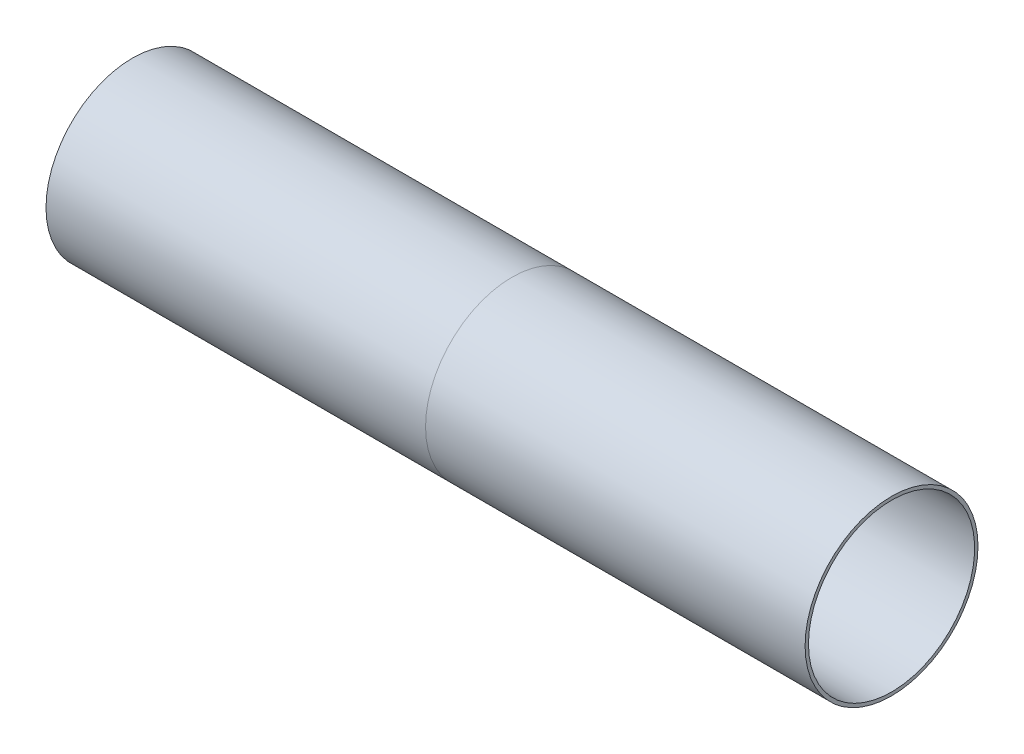
ISO-10303-21;
HEADER;
FILE_DESCRIPTION(('STEP AP214'),'2;1');
FILE_NAME('part.step','',(''),(''),'','','');
FILE_SCHEMA(('AUTOMOTIVE_DESIGN { 1 0 10303 214 1 1 1 1 }'));
ENDSEC;
DATA;
#1=APPLICATION_CONTEXT('core data for automotive mechanical design processes');
#2=APPLICATION_PROTOCOL_DEFINITION('international standard','automotive_design',2000,#1);
#3=PRODUCT_CONTEXT('',#1,'mechanical');
#4=PRODUCT('Part','Part','',(#3));
#5=PRODUCT_RELATED_PRODUCT_CATEGORY('part','',(#4));
#6=PRODUCT_DEFINITION_FORMATION('','',#4);
#7=PRODUCT_DEFINITION_CONTEXT('part definition',#1,'design');
#8=PRODUCT_DEFINITION('design','',#6,#7);
#9=PRODUCT_DEFINITION_SHAPE('','',#8);
#10=(LENGTH_UNIT() NAMED_UNIT(*) SI_UNIT(.MILLI.,.METRE.));
#11=(NAMED_UNIT(*) PLANE_ANGLE_UNIT() SI_UNIT($,.RADIAN.));
#12=(NAMED_UNIT(*) SI_UNIT($,.STERADIAN.) SOLID_ANGLE_UNIT());
#13=UNCERTAINTY_MEASURE_WITH_UNIT(LENGTH_MEASURE(1.E-05),#10,'distance_accuracy_value','');
#14=(GEOMETRIC_REPRESENTATION_CONTEXT(3) GLOBAL_UNCERTAINTY_ASSIGNED_CONTEXT((#13)) GLOBAL_UNIT_ASSIGNED_CONTEXT((#10,
#11,#12)) REPRESENTATION_CONTEXT('',''));
#15=CARTESIAN_POINT('',(0.,0.,0.));
#16=DIRECTION('',(0.,0.,1.));
#17=DIRECTION('',(1.,0.,0.));
#18=AXIS2_PLACEMENT_3D('',#15,#16,#17);
#19=CARTESIAN_POINT('',(-28.6217050315962,0.,-36.7));
#20=DIRECTION('',(1.,0.,0.));
#21=DIRECTION('',(0.,0.,-1.));
#22=AXIS2_PLACEMENT_3D('',#19,#20,#21);
#23=PLANE('',#22);
#24=CARTESIAN_POINT('',(-28.6217050315962,0.,0.));
#25=DIRECTION('',(-1.,0.,0.));
#26=DIRECTION('',(0.,0.,1.));
#27=AXIS2_PLACEMENT_3D('',#24,#25,#26);
#28=CIRCLE('',#27,36.7);
#29=CARTESIAN_POINT('',(-28.6217050315962,0.,36.7));
#30=VERTEX_POINT('',#29);
#31=EDGE_CURVE('E11',#30,#30,#28,.T.);
#32=ORIENTED_EDGE('',*,*,#31,.F.);
#33=EDGE_LOOP('',(#32));
#34=FACE_BOUND('',#33,.T.);
#35=CARTESIAN_POINT('',(-28.6217050315962,0.,0.));
#36=DIRECTION('',(-1.,0.,0.));
#37=DIRECTION('',(0.,0.,1.));
#38=AXIS2_PLACEMENT_3D('',#35,#36,#37);
#39=CIRCLE('',#38,37.9);
#40=CARTESIAN_POINT('',(-28.6217050315962,0.,37.9));
#41=VERTEX_POINT('',#40);
#42=EDGE_CURVE('E86',#41,#41,#39,.T.);
#43=ORIENTED_EDGE('',*,*,#42,.T.);
#44=EDGE_LOOP('',(#43));
#45=FACE_BOUND('',#44,.T.);
#46=ADVANCED_FACE('F62',(#34,#45),#23,.F.);
#47=CARTESIAN_POINT('',(0.,0.,0.));
#48=DIRECTION('',(-1.,0.,0.));
#49=DIRECTION('',(0.,0.,1.));
#50=AXIS2_PLACEMENT_3D('',#47,#48,#49);
#51=CYLINDRICAL_SURFACE('',#50,36.7);
#52=CARTESIAN_POINT('',(28.6217050315962,0.,0.));
#53=DIRECTION('',(-1.,0.,0.));
#54=DIRECTION('',(0.,0.,1.));
#55=AXIS2_PLACEMENT_3D('',#52,#53,#54);
#56=CIRCLE('',#55,36.7);
#57=CARTESIAN_POINT('',(28.6217050315962,0.,36.7));
#58=VERTEX_POINT('',#57);
#59=EDGE_CURVE('E69',#58,#58,#56,.T.);
#60=ORIENTED_EDGE('',*,*,#59,.F.);
#61=EDGE_LOOP('',(#60));
#62=FACE_BOUND('',#61,.T.);
#63=ORIENTED_EDGE('',*,*,#31,.T.);
#64=EDGE_LOOP('',(#63));
#65=FACE_BOUND('',#64,.T.);
#66=ADVANCED_FACE('F105',(#62,#65),#51,.F.);
#67=CARTESIAN_POINT('',(28.6217050315962,0.,-37.9));
#68=DIRECTION('',(-1.,0.,0.));
#69=DIRECTION('',(0.,0.,1.));
#70=AXIS2_PLACEMENT_3D('',#67,#68,#69);
#71=PLANE('',#70);
#72=CARTESIAN_POINT('',(28.6217050315962,0.,0.));
#73=DIRECTION('',(-1.,0.,0.));
#74=DIRECTION('',(0.,0.,1.));
#75=AXIS2_PLACEMENT_3D('',#72,#73,#74);
#76=CIRCLE('',#75,37.9);
#77=CARTESIAN_POINT('',(28.6217050315962,0.,37.9));
#78=VERTEX_POINT('',#77);
#79=EDGE_CURVE('E75',#78,#78,#76,.T.);
#80=ORIENTED_EDGE('',*,*,#79,.F.);
#81=EDGE_LOOP('',(#80));
#82=FACE_BOUND('',#81,.T.);
#83=ORIENTED_EDGE('',*,*,#59,.T.);
#84=EDGE_LOOP('',(#83));
#85=FACE_BOUND('',#84,.T.);
#86=ADVANCED_FACE('F100',(#82,#85),#71,.F.);
#87=CARTESIAN_POINT('',(28.6217050315962,0.,0.));
#88=DIRECTION('',(-1.,0.,0.));
#89=DIRECTION('',(0.,0.,1.));
#90=AXIS2_PLACEMENT_3D('',#87,#88,#89);
#91=CONICAL_SURFACE('',#90,37.9,0.0523598775598231);
#92=CARTESIAN_POINT('',(0.,0.,0.));
#93=DIRECTION('',(-1.,0.,0.));
#94=DIRECTION('',(0.,0.,1.));
#95=AXIS2_PLACEMENT_3D('',#92,#93,#94);
#96=CIRCLE('',#95,39.4);
#97=CARTESIAN_POINT('',(0.,0.,39.4));
#98=VERTEX_POINT('',#97);
#99=EDGE_CURVE('E81',#98,#98,#96,.T.);
#100=ORIENTED_EDGE('',*,*,#99,.F.);
#101=EDGE_LOOP('',(#100));
#102=FACE_BOUND('',#101,.T.);
#103=ORIENTED_EDGE('',*,*,#79,.T.);
#104=EDGE_LOOP('',(#103));
#105=FACE_BOUND('',#104,.T.);
#106=ADVANCED_FACE('F94',(#102,#105),#91,.T.);
#107=CARTESIAN_POINT('',(0.,0.,0.));
#108=DIRECTION('',(1.,0.,0.));
#109=DIRECTION('',(0.,0.,-1.));
#110=AXIS2_PLACEMENT_3D('',#107,#108,#109);
#111=CONICAL_SURFACE('',#110,39.4,0.0523598775598229);
#112=ORIENTED_EDGE('',*,*,#42,.F.);
#113=EDGE_LOOP('',(#112));
#114=FACE_BOUND('',#113,.T.);
#115=ORIENTED_EDGE('',*,*,#99,.T.);
#116=EDGE_LOOP('',(#115));
#117=FACE_BOUND('',#116,.T.);
#118=ADVANCED_FACE('F91',(#114,#117),#111,.T.);
#119=CLOSED_SHELL('',(#46,#66,#86,#106,#118));
#120=MANIFOLD_SOLID_BREP('B2',#119);
#121=CARTESIAN_POINT('',(0.,0.,0.));
#122=DIRECTION('',(-1.,0.,0.));
#123=DIRECTION('',(0.,0.,1.));
#124=AXIS2_PLACEMENT_3D('',#121,#122,#123);
#125=CYLINDRICAL_SURFACE('',#124,39.4);
#126=CARTESIAN_POINT('',(-30.1217050315962,0.,0.));
#127=DIRECTION('',(-1.,0.,0.));
#128=DIRECTION('',(0.,0.,1.));
#129=AXIS2_PLACEMENT_3D('',#126,#127,#128);
#130=CIRCLE('',#129,39.4);
#131=CARTESIAN_POINT('',(-30.1217050315962,0.,39.4));
#132=VERTEX_POINT('',#131);
#133=EDGE_CURVE('E198',#132,#132,#130,.T.);
#134=ORIENTED_EDGE('',*,*,#133,.F.);
#135=EDGE_LOOP('',(#134));
#136=FACE_BOUND('',#135,.T.);
#137=CARTESIAN_POINT('',(-149.878294968404,0.,0.));
#138=DIRECTION('',(1.,0.,0.));
#139=DIRECTION('',(0.,0.,-1.));
#140=AXIS2_PLACEMENT_3D('',#137,#138,#139);
#141=CIRCLE('',#140,39.4);
#142=CARTESIAN_POINT('',(-149.878294968404,0.,-39.4));
#143=VERTEX_POINT('',#142);
#144=EDGE_CURVE('E61',#143,#143,#141,.T.);
#145=ORIENTED_EDGE('',*,*,#144,.F.);
#146=EDGE_LOOP('',(#145));
#147=FACE_BOUND('',#146,.T.);
#148=ADVANCED_FACE('F176',(#136,#147),#125,.F.);
#149=CARTESIAN_POINT('',(0.,0.,0.));
#150=DIRECTION('',(-1.,0.,0.));
#151=DIRECTION('',(0.,0.,1.));
#152=AXIS2_PLACEMENT_3D('',#149,#150,#151);
#153=CYLINDRICAL_SURFACE('',#152,41.);
#154=CARTESIAN_POINT('',(0.,0.,0.));
#155=DIRECTION('',(-1.,0.,0.));
#156=DIRECTION('',(0.,0.,1.));
#157=AXIS2_PLACEMENT_3D('',#154,#155,#156);
#158=CIRCLE('',#157,41.);
#159=CARTESIAN_POINT('',(0.,0.,41.));
#160=VERTEX_POINT('',#159);
#161=EDGE_CURVE('E208',#160,#160,#158,.T.);
#162=ORIENTED_EDGE('',*,*,#161,.T.);
#163=EDGE_LOOP('',(#162));
#164=FACE_BOUND('',#163,.T.);
#165=CARTESIAN_POINT('',(-180.,0.,0.));
#166=DIRECTION('',(-1.,0.,0.));
#167=DIRECTION('',(0.,0.,1.));
#168=AXIS2_PLACEMENT_3D('',#165,#166,#167);
#169=CIRCLE('',#168,41.);
#170=CARTESIAN_POINT('',(-180.,0.,41.));
#171=VERTEX_POINT('',#170);
#172=EDGE_CURVE('E185',#171,#171,#169,.T.);
#173=ORIENTED_EDGE('',*,*,#172,.F.);
#174=EDGE_LOOP('',(#173));
#175=FACE_BOUND('',#174,.T.);
#176=ADVANCED_FACE('F227',(#164,#175),#153,.T.);
#177=CARTESIAN_POINT('',(-180.,0.,0.));
#178=DIRECTION('',(1.,0.,0.));
#179=DIRECTION('',(0.,0.,-1.));
#180=AXIS2_PLACEMENT_3D('',#177,#178,#179);
#181=PLANE('',#180);
#182=CARTESIAN_POINT('',(-180.,0.,0.));
#183=DIRECTION('',(-1.,0.,0.));
#184=DIRECTION('',(0.,0.,1.));
#185=AXIS2_PLACEMENT_3D('',#182,#183,#184);
#186=CIRCLE('',#185,39.4);
#187=CARTESIAN_POINT('',(-180.,0.,39.4));
#188=VERTEX_POINT('',#187);
#189=EDGE_CURVE('E192',#188,#188,#186,.T.);
#190=ORIENTED_EDGE('',*,*,#189,.F.);
#191=EDGE_LOOP('',(#190));
#192=FACE_BOUND('',#191,.T.);
#193=ORIENTED_EDGE('',*,*,#172,.T.);
#194=EDGE_LOOP('',(#193));
#195=FACE_BOUND('',#194,.T.);
#196=ADVANCED_FACE('F223',(#192,#195),#181,.F.);
#197=CARTESIAN_POINT('',(-28.6217050315962,0.,0.));
#198=DIRECTION('',(-1.,0.,0.));
#199=DIRECTION('',(0.,0.,1.));
#200=AXIS2_PLACEMENT_3D('',#197,#198,#199);
#201=CONICAL_SURFACE('',#200,37.9,0.78539816339745);
#202=ORIENTED_EDGE('',*,*,#133,.T.);
#203=EDGE_LOOP('',(#202));
#204=FACE_BOUND('',#203,.T.);
#205=CARTESIAN_POINT('',(-28.6217050315962,0.,0.));
#206=DIRECTION('',(-1.,0.,0.));
#207=DIRECTION('',(0.,0.,1.));
#208=AXIS2_PLACEMENT_3D('',#205,#206,#207);
#209=CIRCLE('',#208,37.9);
#210=CARTESIAN_POINT('',(-28.6217050315962,0.,37.9));
#211=VERTEX_POINT('',#210);
#212=EDGE_CURVE('E202',#211,#211,#209,.T.);
#213=ORIENTED_EDGE('',*,*,#212,.F.);
#214=EDGE_LOOP('',(#213));
#215=FACE_BOUND('',#214,.T.);
#216=ADVANCED_FACE('F226',(#204,#215),#201,.F.);
#217=CARTESIAN_POINT('',(0.,0.,0.));
#218=DIRECTION('',(1.,0.,0.));
#219=DIRECTION('',(0.,0.,-1.));
#220=AXIS2_PLACEMENT_3D('',#217,#218,#219);
#221=CONICAL_SURFACE('',#220,39.4,0.0523598775598229);
#222=ORIENTED_EDGE('',*,*,#212,.T.);
#223=EDGE_LOOP('',(#222));
#224=FACE_BOUND('',#223,.T.);
#225=CARTESIAN_POINT('',(0.,0.,0.));
#226=DIRECTION('',(-1.,0.,0.));
#227=DIRECTION('',(0.,0.,1.));
#228=AXIS2_PLACEMENT_3D('',#225,#226,#227);
#229=CIRCLE('',#228,39.4);
#230=CARTESIAN_POINT('',(0.,0.,39.4));
#231=VERTEX_POINT('',#230);
#232=EDGE_CURVE('E205',#231,#231,#229,.T.);
#233=ORIENTED_EDGE('',*,*,#232,.F.);
#234=EDGE_LOOP('',(#233));
#235=FACE_BOUND('',#234,.T.);
#236=ADVANCED_FACE('F243',(#224,#235),#221,.F.);
#237=CARTESIAN_POINT('',(0.,0.,0.));
#238=DIRECTION('',(1.,0.,0.));
#239=DIRECTION('',(0.,0.,-1.));
#240=AXIS2_PLACEMENT_3D('',#237,#238,#239);
#241=PLANE('',#240);
#242=ORIENTED_EDGE('',*,*,#232,.T.);
#243=EDGE_LOOP('',(#242));
#244=FACE_BOUND('',#243,.T.);
#245=ORIENTED_EDGE('',*,*,#161,.F.);
#246=EDGE_LOOP('',(#245));
#247=FACE_BOUND('',#246,.T.);
#248=ADVANCED_FACE('F239',(#244,#247),#241,.T.);
#249=CARTESIAN_POINT('',(-151.378294968404,0.,0.));
#250=DIRECTION('',(1.,0.,0.));
#251=DIRECTION('',(0.,0.,-1.));
#252=AXIS2_PLACEMENT_3D('',#249,#250,#251);
#253=CONICAL_SURFACE('',#252,37.9,0.785398163397448);
#254=ORIENTED_EDGE('',*,*,#144,.T.);
#255=EDGE_LOOP('',(#254));
#256=FACE_BOUND('',#255,.T.);
#257=CARTESIAN_POINT('',(-151.378294968404,0.,0.));
#258=DIRECTION('',(-1.,0.,0.));
#259=DIRECTION('',(0.,0.,1.));
#260=AXIS2_PLACEMENT_3D('',#257,#258,#259);
#261=CIRCLE('',#260,37.9);
#262=CARTESIAN_POINT('',(-151.378294968404,0.,37.9));
#263=VERTEX_POINT('',#262);
#264=EDGE_CURVE('E180',#263,#263,#261,.T.);
#265=ORIENTED_EDGE('',*,*,#264,.T.);
#266=EDGE_LOOP('',(#265));
#267=FACE_BOUND('',#266,.T.);
#268=ADVANCED_FACE('F178',(#256,#267),#253,.F.);
#269=CARTESIAN_POINT('',(-180.,0.,0.));
#270=DIRECTION('',(-1.,0.,0.));
#271=DIRECTION('',(0.,0.,1.));
#272=AXIS2_PLACEMENT_3D('',#269,#270,#271);
#273=CONICAL_SURFACE('',#272,39.4,0.0523598775598231);
#274=ORIENTED_EDGE('',*,*,#264,.F.);
#275=EDGE_LOOP('',(#274));
#276=FACE_BOUND('',#275,.T.);
#277=ORIENTED_EDGE('',*,*,#189,.T.);
#278=EDGE_LOOP('',(#277));
#279=FACE_BOUND('',#278,.T.);
#280=ADVANCED_FACE('F218',(#276,#279),#273,.F.);
#281=CLOSED_SHELL('',(#148,#176,#196,#216,#236,#248,#268,#280));
#282=MANIFOLD_SOLID_BREP('B6_NOT_SHOWN',#281);
#283=CARTESIAN_POINT('',(0.,0.,0.));
#284=DIRECTION('',(-1.,0.,0.));
#285=DIRECTION('',(0.,0.,1.));
#286=AXIS2_PLACEMENT_3D('',#283,#284,#285);
#287=CONICAL_SURFACE('',#286,39.4,0.0523598775598231);
#288=CARTESIAN_POINT('',(28.6217050315962,0.,0.));
#289=DIRECTION('',(-1.,0.,0.));
#290=DIRECTION('',(0.,0.,1.));
#291=AXIS2_PLACEMENT_3D('',#288,#289,#290);
#292=CIRCLE('',#291,37.9);
#293=CARTESIAN_POINT('',(28.6217050315962,0.,37.9));
#294=VERTEX_POINT('',#293);
#295=EDGE_CURVE('E175',#294,#294,#292,.T.);
#296=ORIENTED_EDGE('',*,*,#295,.F.);
#297=EDGE_LOOP('',(#296));
#298=FACE_BOUND('',#297,.T.);
#299=CARTESIAN_POINT('',(0.,0.,0.));
#300=DIRECTION('',(-1.,0.,0.));
#301=DIRECTION('',(0.,0.,1.));
#302=AXIS2_PLACEMENT_3D('',#299,#300,#301);
#303=CIRCLE('',#302,39.4);
#304=CARTESIAN_POINT('',(0.,0.,39.4));
#305=VERTEX_POINT('',#304);
#306=EDGE_CURVE('E382',#305,#305,#303,.T.);
#307=ORIENTED_EDGE('',*,*,#306,.T.);
#308=EDGE_LOOP('',(#307));
#309=FACE_BOUND('',#308,.T.);
#310=ADVANCED_FACE('F352',(#298,#309),#287,.F.);
#311=CARTESIAN_POINT('',(28.6217050315962,0.,0.));
#312=DIRECTION('',(1.,0.,0.));
#313=DIRECTION('',(0.,0.,-1.));
#314=AXIS2_PLACEMENT_3D('',#311,#312,#313);
#315=CONICAL_SURFACE('',#314,37.9,0.785398163397447);
#316=CARTESIAN_POINT('',(30.1217050315962,0.,0.));
#317=DIRECTION('',(-1.,0.,0.));
#318=DIRECTION('',(0.,0.,1.));
#319=AXIS2_PLACEMENT_3D('',#316,#317,#318);
#320=CIRCLE('',#319,39.4);
#321=CARTESIAN_POINT('',(30.1217050315962,0.,39.4));
#322=VERTEX_POINT('',#321);
#323=EDGE_CURVE('E359',#322,#322,#320,.T.);
#324=ORIENTED_EDGE('',*,*,#323,.F.);
#325=EDGE_LOOP('',(#324));
#326=FACE_BOUND('',#325,.T.);
#327=ORIENTED_EDGE('',*,*,#295,.T.);
#328=EDGE_LOOP('',(#327));
#329=FACE_BOUND('',#328,.T.);
#330=ADVANCED_FACE('F408',(#326,#329),#315,.F.);
#331=CARTESIAN_POINT('',(0.,0.,0.));
#332=DIRECTION('',(-1.,0.,0.));
#333=DIRECTION('',(0.,0.,1.));
#334=AXIS2_PLACEMENT_3D('',#331,#332,#333);
#335=CYLINDRICAL_SURFACE('',#334,39.4);
#336=ORIENTED_EDGE('',*,*,#323,.T.);
#337=EDGE_LOOP('',(#336));
#338=FACE_BOUND('',#337,.T.);
#339=CARTESIAN_POINT('',(180.,0.,0.));
#340=DIRECTION('',(-1.,0.,0.));
#341=DIRECTION('',(0.,0.,1.));
#342=AXIS2_PLACEMENT_3D('',#339,#340,#341);
#343=CIRCLE('',#342,39.4000000000001);
#344=CARTESIAN_POINT('',(180.,0.,39.4000000000001));
#345=VERTEX_POINT('',#344);
#346=EDGE_CURVE('E366',#345,#345,#343,.T.);
#347=ORIENTED_EDGE('',*,*,#346,.F.);
#348=EDGE_LOOP('',(#347));
#349=FACE_BOUND('',#348,.T.);
#350=ADVANCED_FACE('F402',(#338,#349),#335,.F.);
#351=CARTESIAN_POINT('',(180.,0.,0.));
#352=DIRECTION('',(1.,0.,0.));
#353=DIRECTION('',(0.,0.,-1.));
#354=AXIS2_PLACEMENT_3D('',#351,#352,#353);
#355=PLANE('',#354);
#356=ORIENTED_EDGE('',*,*,#346,.T.);
#357=EDGE_LOOP('',(#356));
#358=FACE_BOUND('',#357,.T.);
#359=CARTESIAN_POINT('',(180.,0.,0.));
#360=DIRECTION('',(-1.,0.,0.));
#361=DIRECTION('',(0.,0.,1.));
#362=AXIS2_PLACEMENT_3D('',#359,#360,#361);
#363=CIRCLE('',#362,41.);
#364=CARTESIAN_POINT('',(180.,0.,41.));
#365=VERTEX_POINT('',#364);
#366=EDGE_CURVE('E373',#365,#365,#363,.T.);
#367=ORIENTED_EDGE('',*,*,#366,.F.);
#368=EDGE_LOOP('',(#367));
#369=FACE_BOUND('',#368,.T.);
#370=ADVANCED_FACE('F397',(#358,#369),#355,.T.);
#371=CARTESIAN_POINT('',(0.,0.,0.));
#372=DIRECTION('',(-1.,0.,0.));
#373=DIRECTION('',(0.,0.,1.));
#374=AXIS2_PLACEMENT_3D('',#371,#372,#373);
#375=CYLINDRICAL_SURFACE('',#374,41.);
#376=CARTESIAN_POINT('',(0.,0.,0.));
#377=DIRECTION('',(-1.,0.,0.));
#378=DIRECTION('',(0.,0.,1.));
#379=AXIS2_PLACEMENT_3D('',#376,#377,#378);
#380=CIRCLE('',#379,41.);
#381=CARTESIAN_POINT('',(0.,0.,41.));
#382=VERTEX_POINT('',#381);
#383=EDGE_CURVE('E378',#382,#382,#380,.T.);
#384=ORIENTED_EDGE('',*,*,#383,.F.);
#385=EDGE_LOOP('',(#384));
#386=FACE_BOUND('',#385,.T.);
#387=ORIENTED_EDGE('',*,*,#366,.T.);
#388=EDGE_LOOP('',(#387));
#389=FACE_BOUND('',#388,.T.);
#390=ADVANCED_FACE('F391',(#386,#389),#375,.T.);
#391=CARTESIAN_POINT('',(0.,0.,0.));
#392=DIRECTION('',(1.,0.,0.));
#393=DIRECTION('',(0.,0.,-1.));
#394=AXIS2_PLACEMENT_3D('',#391,#392,#393);
#395=PLANE('',#394);
#396=ORIENTED_EDGE('',*,*,#306,.F.);
#397=EDGE_LOOP('',(#396));
#398=FACE_BOUND('',#397,.T.);
#399=ORIENTED_EDGE('',*,*,#383,.T.);
#400=EDGE_LOOP('',(#399));
#401=FACE_BOUND('',#400,.T.);
#402=ADVANCED_FACE('F388',(#398,#401),#395,.F.);
#403=CLOSED_SHELL('',(#310,#330,#350,#370,#390,#402));
#404=MANIFOLD_SOLID_BREP('B56_NOT_SHOWN',#403);
#405=ADVANCED_BREP_SHAPE_REPRESENTATION('',(#18,#120,#282,#404),#14);
#406=SHAPE_DEFINITION_REPRESENTATION(#9,#405);
ENDSEC;
END-ISO-10303-21;
